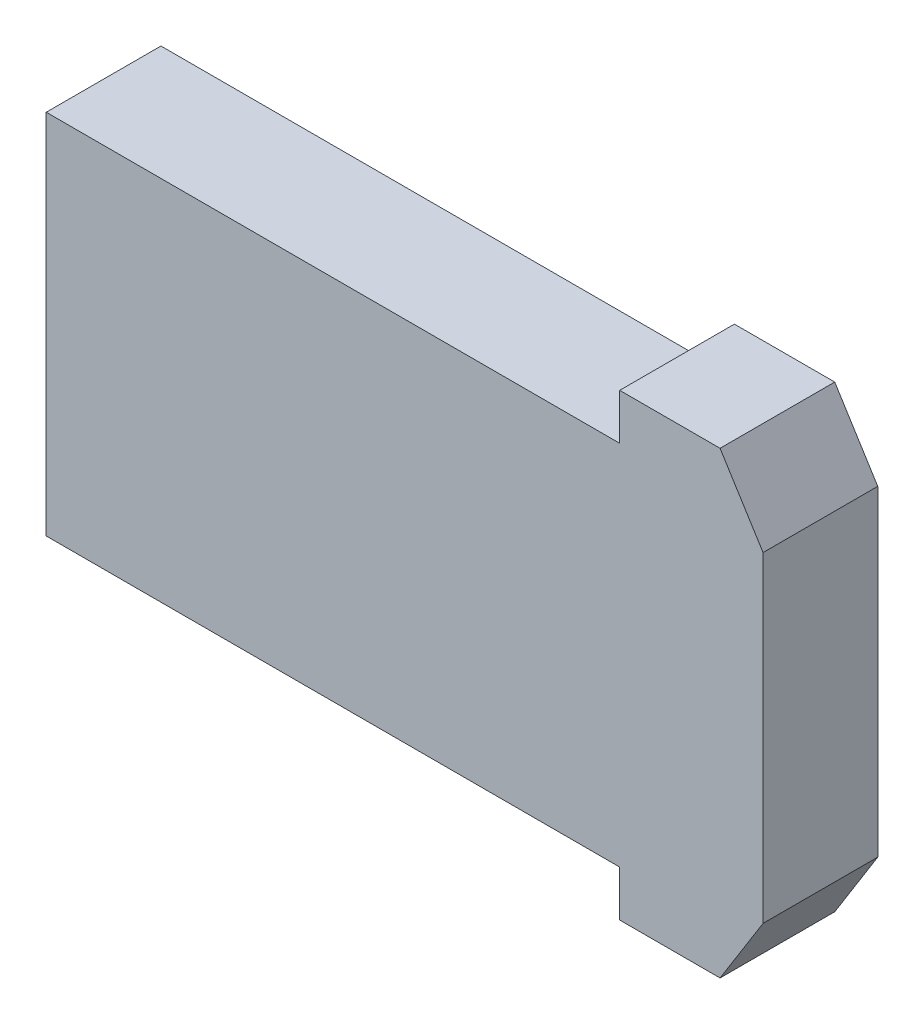
ISO-10303-21;
HEADER;
FILE_DESCRIPTION(('STEP AP214'),'2;1');
FILE_NAME('part.step','',(''),(''),'','','');
FILE_SCHEMA(('AUTOMOTIVE_DESIGN { 1 0 10303 214 1 1 1 1 }'));
ENDSEC;
DATA;
#1=APPLICATION_CONTEXT('core data for automotive mechanical design processes');
#2=APPLICATION_PROTOCOL_DEFINITION('international standard','automotive_design',2000,#1);
#3=PRODUCT_CONTEXT('',#1,'mechanical');
#4=PRODUCT('Part','Part','',(#3));
#5=PRODUCT_RELATED_PRODUCT_CATEGORY('part','',(#4));
#6=PRODUCT_DEFINITION_FORMATION('','',#4);
#7=PRODUCT_DEFINITION_CONTEXT('part definition',#1,'design');
#8=PRODUCT_DEFINITION('design','',#6,#7);
#9=PRODUCT_DEFINITION_SHAPE('','',#8);
#10=(LENGTH_UNIT() NAMED_UNIT(*) SI_UNIT(.MILLI.,.METRE.));
#11=(NAMED_UNIT(*) PLANE_ANGLE_UNIT() SI_UNIT($,.RADIAN.));
#12=(NAMED_UNIT(*) SI_UNIT($,.STERADIAN.) SOLID_ANGLE_UNIT());
#13=UNCERTAINTY_MEASURE_WITH_UNIT(LENGTH_MEASURE(1.E-05),#10,'distance_accuracy_value','');
#14=(GEOMETRIC_REPRESENTATION_CONTEXT(3) GLOBAL_UNCERTAINTY_ASSIGNED_CONTEXT((#13)) GLOBAL_UNIT_ASSIGNED_CONTEXT((#10,
#11,#12)) REPRESENTATION_CONTEXT('',''));
#15=CARTESIAN_POINT('',(0.,0.,0.));
#16=DIRECTION('',(0.,0.,1.));
#17=DIRECTION('',(1.,0.,0.));
#18=AXIS2_PLACEMENT_3D('',#15,#16,#17);
#19=CARTESIAN_POINT('',(0.544151509358,0.,0.));
#20=DIRECTION('',(0.,0.,-1.));
#21=DIRECTION('',(-1.,0.,0.));
#22=AXIS2_PLACEMENT_3D('',#19,#20,#21);
#23=PLANE('',#22);
#24=DIRECTION('',(1.,0.,0.));
#25=VECTOR('',#24,1.);
#26=CARTESIAN_POINT('',(1.25,0.8,0.));
#27=LINE('',#26,#25);
#28=CARTESIAN_POINT('',(1.6,0.8,0.));
#29=VERTEX_POINT('',#28);
#30=CARTESIAN_POINT('',(1.25,0.8,0.));
#31=VERTEX_POINT('',#30);
#32=EDGE_CURVE('E136',#29,#31,#27,.F.);
#33=ORIENTED_EDGE('',*,*,#32,.F.);
#34=DIRECTION('',(-0.52999894000309,0.847998304005144,0.));
#35=VECTOR('',#34,1.);
#36=CARTESIAN_POINT('',(1.6,0.8,0.));
#37=LINE('',#36,#35);
#38=CARTESIAN_POINT('',(1.74999999999999,0.559999999999996,0.));
#39=VERTEX_POINT('',#38);
#40=EDGE_CURVE('E141',#39,#29,#37,.T.);
#41=ORIENTED_EDGE('',*,*,#40,.F.);
#42=DIRECTION('',(0.,1.,0.));
#43=VECTOR('',#42,1.);
#44=CARTESIAN_POINT('',(1.75,0.,0.));
#45=LINE('',#44,#43);
#46=CARTESIAN_POINT('',(1.75,-0.56,0.));
#47=VERTEX_POINT('',#46);
#48=EDGE_CURVE('E94',#47,#39,#45,.T.);
#49=ORIENTED_EDGE('',*,*,#48,.F.);
#50=DIRECTION('',(0.52999894000309,0.847998304005144,0.));
#51=VECTOR('',#50,1.);
#52=CARTESIAN_POINT('',(1.75,-0.56,0.));
#53=LINE('',#52,#51);
#54=CARTESIAN_POINT('',(1.60000000000001,-0.800000000000008,0.));
#55=VERTEX_POINT('',#54);
#56=EDGE_CURVE('E20',#55,#47,#53,.T.);
#57=ORIENTED_EDGE('',*,*,#56,.F.);
#58=DIRECTION('',(1.,0.,0.));
#59=VECTOR('',#58,1.);
#60=CARTESIAN_POINT('',(1.6,-0.8,0.));
#61=LINE('',#60,#59);
#62=CARTESIAN_POINT('',(1.25,-0.8,0.));
#63=VERTEX_POINT('',#62);
#64=EDGE_CURVE('E90',#63,#55,#61,.T.);
#65=ORIENTED_EDGE('',*,*,#64,.F.);
#66=DIRECTION('',(0.,1.,0.));
#67=VECTOR('',#66,1.);
#68=CARTESIAN_POINT('',(1.25,-0.8,0.));
#69=LINE('',#68,#67);
#70=CARTESIAN_POINT('',(1.25,-0.64,0.));
#71=VERTEX_POINT('',#70);
#72=EDGE_CURVE('E112',#71,#63,#69,.F.);
#73=ORIENTED_EDGE('',*,*,#72,.F.);
#74=DIRECTION('',(1.,0.,0.));
#75=VECTOR('',#74,1.);
#76=CARTESIAN_POINT('',(1.25,-0.64,0.));
#77=LINE('',#76,#75);
#78=CARTESIAN_POINT('',(-0.75,-0.64,0.));
#79=VERTEX_POINT('',#78);
#80=EDGE_CURVE('E116',#79,#71,#77,.T.);
#81=ORIENTED_EDGE('',*,*,#80,.F.);
#82=DIRECTION('',(0.,1.,0.));
#83=VECTOR('',#82,1.);
#84=CARTESIAN_POINT('',(-0.75,-0.64,0.));
#85=LINE('',#84,#83);
#86=CARTESIAN_POINT('',(-0.75,0.64,0.));
#87=VERTEX_POINT('',#86);
#88=EDGE_CURVE('E121',#87,#79,#85,.F.);
#89=ORIENTED_EDGE('',*,*,#88,.F.);
#90=DIRECTION('',(1.,0.,0.));
#91=VECTOR('',#90,1.);
#92=CARTESIAN_POINT('',(-0.75,0.64,0.));
#93=LINE('',#92,#91);
#94=CARTESIAN_POINT('',(1.25,0.64,0.));
#95=VERTEX_POINT('',#94);
#96=EDGE_CURVE('E126',#95,#87,#93,.F.);
#97=ORIENTED_EDGE('',*,*,#96,.F.);
#98=DIRECTION('',(0.,1.,0.));
#99=VECTOR('',#98,1.);
#100=CARTESIAN_POINT('',(1.25,0.64,0.));
#101=LINE('',#100,#99);
#102=EDGE_CURVE('E131',#31,#95,#101,.F.);
#103=ORIENTED_EDGE('',*,*,#102,.F.);
#104=EDGE_LOOP('',(#33,#41,#49,#57,#65,#73,#81,#89,#97,#103));
#105=FACE_BOUND('',#104,.T.);
#106=ADVANCED_FACE('F17',(#105),#23,.T.);
#107=CARTESIAN_POINT('',(1.75,-0.56,0.));
#108=DIRECTION('',(0.847998304005144,-0.52999894000309,0.));
#109=DIRECTION('',(0.52999894000309,0.847998304005144,0.));
#110=AXIS2_PLACEMENT_3D('',#107,#108,#109);
#111=PLANE('',#110);
#112=DIRECTION('',(0.,0.,-1.));
#113=VECTOR('',#112,1.);
#114=CARTESIAN_POINT('',(1.6,-0.8,0.));
#115=LINE('',#114,#113);
#116=CARTESIAN_POINT('',(1.60000000000001,-0.800000000000008,0.4));
#117=VERTEX_POINT('',#116);
#118=EDGE_CURVE('E99',#55,#117,#115,.F.);
#119=ORIENTED_EDGE('',*,*,#118,.F.);
#120=ORIENTED_EDGE('',*,*,#56,.T.);
#121=DIRECTION('',(0.,0.,-1.));
#122=VECTOR('',#121,1.);
#123=CARTESIAN_POINT('',(1.75,-0.56,0.));
#124=LINE('',#123,#122);
#125=CARTESIAN_POINT('',(1.75,-0.56,0.4));
#126=VERTEX_POINT('',#125);
#127=EDGE_CURVE('E144',#126,#47,#124,.T.);
#128=ORIENTED_EDGE('',*,*,#127,.F.);
#129=DIRECTION('',(-0.52999894000318,-0.847998304005088,0.));
#130=VECTOR('',#129,1.);
#131=CARTESIAN_POINT('',(1.75,-0.56,0.4));
#132=LINE('',#131,#130);
#133=EDGE_CURVE('E109',#126,#117,#132,.T.);
#134=ORIENTED_EDGE('',*,*,#133,.T.);
#135=EDGE_LOOP('',(#119,#120,#128,#134));
#136=FACE_BOUND('',#135,.T.);
#137=ADVANCED_FACE('F108',(#136),#111,.T.);
#138=CARTESIAN_POINT('',(1.6,-0.8,0.));
#139=DIRECTION('',(0.,-1.,0.));
#140=DIRECTION('',(0.,0.,-1.));
#141=AXIS2_PLACEMENT_3D('',#138,#139,#140);
#142=PLANE('',#141);
#143=DIRECTION('',(0.,0.,1.));
#144=VECTOR('',#143,1.);
#145=CARTESIAN_POINT('',(1.25,-0.8,0.));
#146=LINE('',#145,#144);
#147=CARTESIAN_POINT('',(1.25,-0.8,0.4));
#148=VERTEX_POINT('',#147);
#149=EDGE_CURVE('E105',#63,#148,#146,.T.);
#150=ORIENTED_EDGE('',*,*,#149,.F.);
#151=ORIENTED_EDGE('',*,*,#64,.T.);
#152=ORIENTED_EDGE('',*,*,#118,.T.);
#153=DIRECTION('',(-1.,0.,0.));
#154=VECTOR('',#153,1.);
#155=CARTESIAN_POINT('',(0.544151509358,-0.8,0.4));
#156=LINE('',#155,#154);
#157=EDGE_CURVE('E149',#117,#148,#156,.T.);
#158=ORIENTED_EDGE('',*,*,#157,.T.);
#159=EDGE_LOOP('',(#150,#151,#152,#158));
#160=FACE_BOUND('',#159,.T.);
#161=ADVANCED_FACE('F102',(#160),#142,.T.);
#162=CARTESIAN_POINT('',(1.25,-0.8,0.));
#163=DIRECTION('',(-1.,0.,0.));
#164=DIRECTION('',(0.,0.,1.));
#165=AXIS2_PLACEMENT_3D('',#162,#163,#164);
#166=PLANE('',#165);
#167=DIRECTION('',(0.,0.,-1.));
#168=VECTOR('',#167,1.);
#169=CARTESIAN_POINT('',(1.25,-0.64,0.));
#170=LINE('',#169,#168);
#171=CARTESIAN_POINT('',(1.25,-0.64,0.4));
#172=VERTEX_POINT('',#171);
#173=EDGE_CURVE('E114',#71,#172,#170,.F.);
#174=ORIENTED_EDGE('',*,*,#173,.F.);
#175=ORIENTED_EDGE('',*,*,#72,.T.);
#176=ORIENTED_EDGE('',*,*,#149,.T.);
#177=DIRECTION('',(0.,1.,0.));
#178=VECTOR('',#177,1.);
#179=CARTESIAN_POINT('',(1.25,0.,0.4));
#180=LINE('',#179,#178);
#181=EDGE_CURVE('E151',#148,#172,#180,.T.);
#182=ORIENTED_EDGE('',*,*,#181,.T.);
#183=EDGE_LOOP('',(#174,#175,#176,#182));
#184=FACE_BOUND('',#183,.T.);
#185=ADVANCED_FACE('F198',(#184),#166,.T.);
#186=CARTESIAN_POINT('',(1.25,-0.64,0.));
#187=DIRECTION('',(0.,-1.,0.));
#188=DIRECTION('',(0.,0.,-1.));
#189=AXIS2_PLACEMENT_3D('',#186,#187,#188);
#190=PLANE('',#189);
#191=DIRECTION('',(0.,0.,1.));
#192=VECTOR('',#191,1.);
#193=CARTESIAN_POINT('',(-0.75,-0.64,0.));
#194=LINE('',#193,#192);
#195=CARTESIAN_POINT('',(-0.75,-0.64,0.4));
#196=VERTEX_POINT('',#195);
#197=EDGE_CURVE('E119',#79,#196,#194,.T.);
#198=ORIENTED_EDGE('',*,*,#197,.F.);
#199=ORIENTED_EDGE('',*,*,#80,.T.);
#200=ORIENTED_EDGE('',*,*,#173,.T.);
#201=DIRECTION('',(-1.,0.,0.));
#202=VECTOR('',#201,1.);
#203=CARTESIAN_POINT('',(0.544151509358,-0.64,0.4));
#204=LINE('',#203,#202);
#205=EDGE_CURVE('E154',#172,#196,#204,.T.);
#206=ORIENTED_EDGE('',*,*,#205,.T.);
#207=EDGE_LOOP('',(#198,#199,#200,#206));
#208=FACE_BOUND('',#207,.T.);
#209=ADVANCED_FACE('F195',(#208),#190,.T.);
#210=CARTESIAN_POINT('',(-0.75,-0.64,0.));
#211=DIRECTION('',(-1.,0.,0.));
#212=DIRECTION('',(0.,0.,1.));
#213=AXIS2_PLACEMENT_3D('',#210,#211,#212);
#214=PLANE('',#213);
#215=DIRECTION('',(0.,0.,1.));
#216=VECTOR('',#215,1.);
#217=CARTESIAN_POINT('',(-0.75,0.64,0.));
#218=LINE('',#217,#216);
#219=CARTESIAN_POINT('',(-0.75,0.64,0.4));
#220=VERTEX_POINT('',#219);
#221=EDGE_CURVE('E124',#87,#220,#218,.T.);
#222=ORIENTED_EDGE('',*,*,#221,.F.);
#223=ORIENTED_EDGE('',*,*,#88,.T.);
#224=ORIENTED_EDGE('',*,*,#197,.T.);
#225=DIRECTION('',(0.,1.,0.));
#226=VECTOR('',#225,1.);
#227=CARTESIAN_POINT('',(-0.75,0.,0.4));
#228=LINE('',#227,#226);
#229=EDGE_CURVE('E157',#196,#220,#228,.T.);
#230=ORIENTED_EDGE('',*,*,#229,.T.);
#231=EDGE_LOOP('',(#222,#223,#224,#230));
#232=FACE_BOUND('',#231,.T.);
#233=ADVANCED_FACE('F190',(#232),#214,.T.);
#234=CARTESIAN_POINT('',(-0.75,0.64,0.));
#235=DIRECTION('',(0.,1.,0.));
#236=DIRECTION('',(0.,0.,1.));
#237=AXIS2_PLACEMENT_3D('',#234,#235,#236);
#238=PLANE('',#237);
#239=DIRECTION('',(0.,0.,1.));
#240=VECTOR('',#239,1.);
#241=CARTESIAN_POINT('',(1.25,0.64,0.));
#242=LINE('',#241,#240);
#243=CARTESIAN_POINT('',(1.25,0.64,0.4));
#244=VERTEX_POINT('',#243);
#245=EDGE_CURVE('E129',#95,#244,#242,.T.);
#246=ORIENTED_EDGE('',*,*,#245,.F.);
#247=ORIENTED_EDGE('',*,*,#96,.T.);
#248=ORIENTED_EDGE('',*,*,#221,.T.);
#249=DIRECTION('',(-1.,0.,0.));
#250=VECTOR('',#249,1.);
#251=CARTESIAN_POINT('',(0.544151509358,0.64,0.4));
#252=LINE('',#251,#250);
#253=EDGE_CURVE('E160',#220,#244,#252,.F.);
#254=ORIENTED_EDGE('',*,*,#253,.T.);
#255=EDGE_LOOP('',(#246,#247,#248,#254));
#256=FACE_BOUND('',#255,.T.);
#257=ADVANCED_FACE('F187',(#256),#238,.T.);
#258=CARTESIAN_POINT('',(1.25,0.64,0.));
#259=DIRECTION('',(-1.,0.,0.));
#260=DIRECTION('',(0.,0.,1.));
#261=AXIS2_PLACEMENT_3D('',#258,#259,#260);
#262=PLANE('',#261);
#263=DIRECTION('',(0.,0.,1.));
#264=VECTOR('',#263,1.);
#265=CARTESIAN_POINT('',(1.25,0.8,0.));
#266=LINE('',#265,#264);
#267=CARTESIAN_POINT('',(1.25,0.8,0.4));
#268=VERTEX_POINT('',#267);
#269=EDGE_CURVE('E134',#31,#268,#266,.T.);
#270=ORIENTED_EDGE('',*,*,#269,.F.);
#271=ORIENTED_EDGE('',*,*,#102,.T.);
#272=ORIENTED_EDGE('',*,*,#245,.T.);
#273=DIRECTION('',(0.,1.,0.));
#274=VECTOR('',#273,1.);
#275=CARTESIAN_POINT('',(1.25,0.,0.4));
#276=LINE('',#275,#274);
#277=EDGE_CURVE('E163',#244,#268,#276,.T.);
#278=ORIENTED_EDGE('',*,*,#277,.T.);
#279=EDGE_LOOP('',(#270,#271,#272,#278));
#280=FACE_BOUND('',#279,.T.);
#281=ADVANCED_FACE('F182',(#280),#262,.T.);
#282=CARTESIAN_POINT('',(1.25,0.8,0.));
#283=DIRECTION('',(0.,1.,0.));
#284=DIRECTION('',(0.,0.,1.));
#285=AXIS2_PLACEMENT_3D('',#282,#283,#284);
#286=PLANE('',#285);
#287=DIRECTION('',(0.,0.,1.));
#288=VECTOR('',#287,1.);
#289=CARTESIAN_POINT('',(1.6,0.8,0.));
#290=LINE('',#289,#288);
#291=CARTESIAN_POINT('',(1.6,0.8,0.4));
#292=VERTEX_POINT('',#291);
#293=EDGE_CURVE('E139',#29,#292,#290,.T.);
#294=ORIENTED_EDGE('',*,*,#293,.F.);
#295=ORIENTED_EDGE('',*,*,#32,.T.);
#296=ORIENTED_EDGE('',*,*,#269,.T.);
#297=DIRECTION('',(-1.,0.,0.));
#298=VECTOR('',#297,1.);
#299=CARTESIAN_POINT('',(0.544151509358,0.8,0.4));
#300=LINE('',#299,#298);
#301=EDGE_CURVE('E166',#268,#292,#300,.F.);
#302=ORIENTED_EDGE('',*,*,#301,.T.);
#303=EDGE_LOOP('',(#294,#295,#296,#302));
#304=FACE_BOUND('',#303,.T.);
#305=ADVANCED_FACE('F179',(#304),#286,.T.);
#306=CARTESIAN_POINT('',(1.6,0.8,0.));
#307=DIRECTION('',(0.847998304005144,0.52999894000309,0.));
#308=DIRECTION('',(-0.52999894000309,0.847998304005144,0.));
#309=AXIS2_PLACEMENT_3D('',#306,#307,#308);
#310=PLANE('',#309);
#311=DIRECTION('',(0.,0.,-1.));
#312=VECTOR('',#311,1.);
#313=CARTESIAN_POINT('',(1.75,0.56,0.));
#314=LINE('',#313,#312);
#315=CARTESIAN_POINT('',(1.74999999999999,0.559999999999992,0.4));
#316=VERTEX_POINT('',#315);
#317=EDGE_CURVE('E34',#39,#316,#314,.F.);
#318=ORIENTED_EDGE('',*,*,#317,.F.);
#319=ORIENTED_EDGE('',*,*,#40,.T.);
#320=ORIENTED_EDGE('',*,*,#293,.T.);
#321=DIRECTION('',(0.52999894000318,-0.847998304005088,0.));
#322=VECTOR('',#321,1.);
#323=CARTESIAN_POINT('',(1.6,0.8,0.4));
#324=LINE('',#323,#322);
#325=EDGE_CURVE('E26',#292,#316,#324,.T.);
#326=ORIENTED_EDGE('',*,*,#325,.T.);
#327=EDGE_LOOP('',(#318,#319,#320,#326));
#328=FACE_BOUND('',#327,.T.);
#329=ADVANCED_FACE('F172',(#328),#310,.T.);
#330=CARTESIAN_POINT('',(1.75,0.,0.));
#331=DIRECTION('',(1.,0.,0.));
#332=DIRECTION('',(0.,0.,-1.));
#333=AXIS2_PLACEMENT_3D('',#330,#331,#332);
#334=PLANE('',#333);
#335=ORIENTED_EDGE('',*,*,#317,.T.);
#336=DIRECTION('',(0.,1.,0.));
#337=VECTOR('',#336,1.);
#338=CARTESIAN_POINT('',(1.75,0.,0.4));
#339=LINE('',#338,#337);
#340=EDGE_CURVE('E11',#316,#126,#339,.F.);
#341=ORIENTED_EDGE('',*,*,#340,.T.);
#342=ORIENTED_EDGE('',*,*,#127,.T.);
#343=ORIENTED_EDGE('',*,*,#48,.T.);
#344=EDGE_LOOP('',(#335,#341,#342,#343));
#345=FACE_BOUND('',#344,.T.);
#346=ADVANCED_FACE('F199',(#345),#334,.T.);
#347=CARTESIAN_POINT('',(0.544151509358,0.,0.4));
#348=DIRECTION('',(0.,0.,-1.));
#349=DIRECTION('',(-1.,0.,0.));
#350=AXIS2_PLACEMENT_3D('',#347,#348,#349);
#351=PLANE('',#350);
#352=ORIENTED_EDGE('',*,*,#325,.F.);
#353=ORIENTED_EDGE('',*,*,#301,.F.);
#354=ORIENTED_EDGE('',*,*,#277,.F.);
#355=ORIENTED_EDGE('',*,*,#253,.F.);
#356=ORIENTED_EDGE('',*,*,#229,.F.);
#357=ORIENTED_EDGE('',*,*,#205,.F.);
#358=ORIENTED_EDGE('',*,*,#181,.F.);
#359=ORIENTED_EDGE('',*,*,#157,.F.);
#360=ORIENTED_EDGE('',*,*,#133,.F.);
#361=ORIENTED_EDGE('',*,*,#340,.F.);
#362=EDGE_LOOP('',(#352,#353,#354,#355,#356,#357,#358,#359,#360,#361));
#363=FACE_BOUND('',#362,.T.);
#364=ADVANCED_FACE('F176',(#363),#351,.F.);
#365=CLOSED_SHELL('',(#106,#137,#161,#185,#209,#233,#257,#281,#305,#329,#346,#364));
#366=MANIFOLD_SOLID_BREP('B1',#365);
#367=ADVANCED_BREP_SHAPE_REPRESENTATION('',(#18,#366),#14);
#368=SHAPE_DEFINITION_REPRESENTATION(#9,#367);
ENDSEC;
END-ISO-10303-21;
